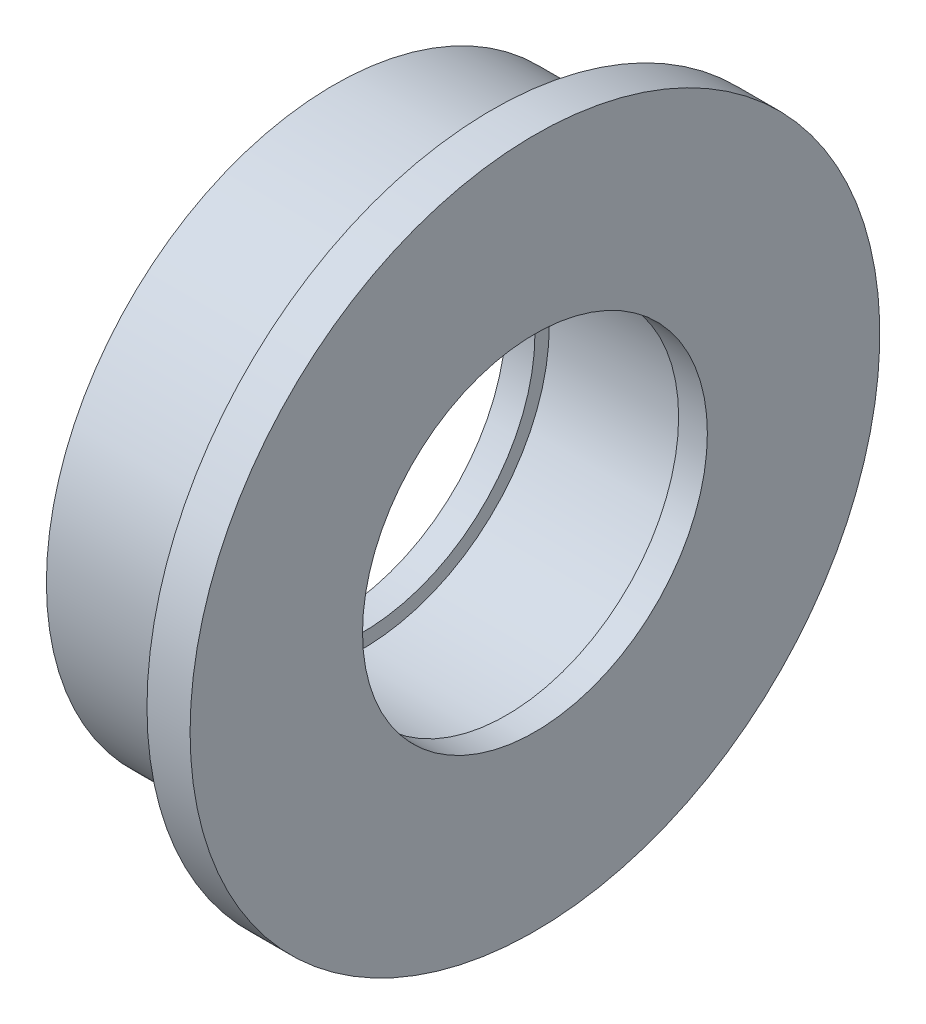
ISO-10303-21;
HEADER;
FILE_DESCRIPTION(('STEP AP214'),'2;1');
FILE_NAME('part.step','',(''),(''),'','','');
FILE_SCHEMA(('AUTOMOTIVE_DESIGN { 1 0 10303 214 1 1 1 1 }'));
ENDSEC;
DATA;
#1=APPLICATION_CONTEXT('core data for automotive mechanical design processes');
#2=APPLICATION_PROTOCOL_DEFINITION('international standard','automotive_design',2000,#1);
#3=PRODUCT_CONTEXT('',#1,'mechanical');
#4=PRODUCT('Part','Part','',(#3));
#5=PRODUCT_RELATED_PRODUCT_CATEGORY('part','',(#4));
#6=PRODUCT_DEFINITION_FORMATION('','',#4);
#7=PRODUCT_DEFINITION_CONTEXT('part definition',#1,'design');
#8=PRODUCT_DEFINITION('design','',#6,#7);
#9=PRODUCT_DEFINITION_SHAPE('','',#8);
#10=(LENGTH_UNIT() NAMED_UNIT(*) SI_UNIT(.MILLI.,.METRE.));
#11=(NAMED_UNIT(*) PLANE_ANGLE_UNIT() SI_UNIT($,.RADIAN.));
#12=(NAMED_UNIT(*) SI_UNIT($,.STERADIAN.) SOLID_ANGLE_UNIT());
#13=UNCERTAINTY_MEASURE_WITH_UNIT(LENGTH_MEASURE(1.E-05),#10,'distance_accuracy_value','');
#14=(GEOMETRIC_REPRESENTATION_CONTEXT(3) GLOBAL_UNCERTAINTY_ASSIGNED_CONTEXT((#13)) GLOBAL_UNIT_ASSIGNED_CONTEXT((#10,
#11,#12)) REPRESENTATION_CONTEXT('',''));
#15=CARTESIAN_POINT('',(0.,0.,0.));
#16=DIRECTION('',(0.,0.,1.));
#17=DIRECTION('',(1.,0.,0.));
#18=AXIS2_PLACEMENT_3D('',#15,#16,#17);
#19=CARTESIAN_POINT('',(2.5,-6.5,-6.63));
#20=DIRECTION('',(-1.,0.,0.));
#21=DIRECTION('',(0.,0.,1.));
#22=AXIS2_PLACEMENT_3D('',#19,#20,#21);
#23=PLANE('',#22);
#24=CARTESIAN_POINT('',(2.5,0.,0.));
#25=DIRECTION('',(1.,0.,0.));
#26=DIRECTION('',(0.,0.,-1.));
#27=AXIS2_PLACEMENT_3D('',#24,#25,#26);
#28=CIRCLE('',#27,6.);
#29=CARTESIAN_POINT('',(2.5,0.,-6.));
#30=VERTEX_POINT('',#29);
#31=EDGE_CURVE('E19',#30,#30,#28,.F.);
#32=ORIENTED_EDGE('',*,*,#31,.F.);
#33=EDGE_LOOP('',(#32));
#34=FACE_BOUND('',#33,.T.);
#35=CARTESIAN_POINT('',(2.5,0.,0.));
#36=DIRECTION('',(1.,0.,0.));
#37=DIRECTION('',(0.,0.,-1.));
#38=AXIS2_PLACEMENT_3D('',#35,#36,#37);
#39=CIRCLE('',#38,6.5);
#40=CARTESIAN_POINT('',(2.5,0.,-6.5));
#41=VERTEX_POINT('',#40);
#42=EDGE_CURVE('E47',#41,#41,#39,.T.);
#43=ORIENTED_EDGE('',*,*,#42,.F.);
#44=EDGE_LOOP('',(#43));
#45=FACE_BOUND('',#44,.T.);
#46=ADVANCED_FACE('F15',(#34,#45),#23,.T.);
#47=CARTESIAN_POINT('',(2.5,0.,0.));
#48=DIRECTION('',(1.,0.,0.));
#49=DIRECTION('',(0.,0.,-1.));
#50=AXIS2_PLACEMENT_3D('',#47,#48,#49);
#51=CYLINDRICAL_SURFACE('',#50,6.);
#52=ORIENTED_EDGE('',*,*,#31,.T.);
#53=EDGE_LOOP('',(#52));
#54=FACE_BOUND('',#53,.T.);
#55=CARTESIAN_POINT('',(3.5,0.,0.));
#56=DIRECTION('',(1.,0.,0.));
#57=DIRECTION('',(0.,0.,-1.));
#58=AXIS2_PLACEMENT_3D('',#55,#56,#57);
#59=CIRCLE('',#58,6.);
#60=CARTESIAN_POINT('',(3.5,0.,-6.));
#61=VERTEX_POINT('',#60);
#62=EDGE_CURVE('E45',#61,#61,#59,.F.);
#63=ORIENTED_EDGE('',*,*,#62,.F.);
#64=EDGE_LOOP('',(#63));
#65=FACE_BOUND('',#64,.T.);
#66=ADVANCED_FACE('F54',(#54,#65),#51,.F.);
#67=CARTESIAN_POINT('',(-2.5,0.,0.));
#68=DIRECTION('',(1.,0.,0.));
#69=DIRECTION('',(0.,0.,-1.));
#70=AXIS2_PLACEMENT_3D('',#67,#68,#69);
#71=CYLINDRICAL_SURFACE('',#70,6.5);
#72=CARTESIAN_POINT('',(-2.5,0.,0.));
#73=DIRECTION('',(1.,0.,0.));
#74=DIRECTION('',(0.,0.,-1.));
#75=AXIS2_PLACEMENT_3D('',#72,#73,#74);
#76=CIRCLE('',#75,6.5);
#77=CARTESIAN_POINT('',(-2.5,0.,-6.5));
#78=VERTEX_POINT('',#77);
#79=EDGE_CURVE('E42',#78,#78,#76,.T.);
#80=ORIENTED_EDGE('',*,*,#79,.F.);
#81=EDGE_LOOP('',(#80));
#82=FACE_BOUND('',#81,.T.);
#83=ORIENTED_EDGE('',*,*,#42,.T.);
#84=EDGE_LOOP('',(#83));
#85=FACE_BOUND('',#84,.T.);
#86=ADVANCED_FACE('F64',(#82,#85),#71,.F.);
#87=CARTESIAN_POINT('',(3.5,-12.,12.24));
#88=DIRECTION('',(1.,0.,0.));
#89=DIRECTION('',(0.,0.,-1.));
#90=AXIS2_PLACEMENT_3D('',#87,#88,#89);
#91=PLANE('',#90);
#92=ORIENTED_EDGE('',*,*,#62,.T.);
#93=EDGE_LOOP('',(#92));
#94=FACE_BOUND('',#93,.T.);
#95=CARTESIAN_POINT('',(3.5,0.,0.));
#96=DIRECTION('',(-1.,0.,0.));
#97=DIRECTION('',(0.,0.,1.));
#98=AXIS2_PLACEMENT_3D('',#95,#96,#97);
#99=CIRCLE('',#98,12.);
#100=CARTESIAN_POINT('',(3.5,0.,12.));
#101=VERTEX_POINT('',#100);
#102=EDGE_CURVE('E39',#101,#101,#99,.T.);
#103=ORIENTED_EDGE('',*,*,#102,.F.);
#104=EDGE_LOOP('',(#103));
#105=FACE_BOUND('',#104,.T.);
#106=ADVANCED_FACE('F89',(#94,#105),#91,.T.);
#107=CARTESIAN_POINT('',(-2.5,-6.5,6.63));
#108=DIRECTION('',(1.,0.,0.));
#109=DIRECTION('',(0.,0.,-1.));
#110=AXIS2_PLACEMENT_3D('',#107,#108,#109);
#111=PLANE('',#110);
#112=CARTESIAN_POINT('',(-2.5,0.,0.));
#113=DIRECTION('',(1.,0.,0.));
#114=DIRECTION('',(0.,0.,-1.));
#115=AXIS2_PLACEMENT_3D('',#112,#113,#114);
#116=CIRCLE('',#115,6.);
#117=CARTESIAN_POINT('',(-2.5,0.,-6.));
#118=VERTEX_POINT('',#117);
#119=EDGE_CURVE('E36',#118,#118,#116,.T.);
#120=ORIENTED_EDGE('',*,*,#119,.F.);
#121=EDGE_LOOP('',(#120));
#122=FACE_BOUND('',#121,.T.);
#123=ORIENTED_EDGE('',*,*,#79,.T.);
#124=EDGE_LOOP('',(#123));
#125=FACE_BOUND('',#124,.T.);
#126=ADVANCED_FACE('F85',(#122,#125),#111,.T.);
#127=CARTESIAN_POINT('',(3.5,0.,0.));
#128=DIRECTION('',(-1.,0.,0.));
#129=DIRECTION('',(0.,0.,1.));
#130=AXIS2_PLACEMENT_3D('',#127,#128,#129);
#131=CYLINDRICAL_SURFACE('',#130,12.);
#132=CARTESIAN_POINT('',(2.,0.,0.));
#133=DIRECTION('',(-1.,0.,0.));
#134=DIRECTION('',(0.,0.,1.));
#135=AXIS2_PLACEMENT_3D('',#132,#133,#134);
#136=CIRCLE('',#135,12.);
#137=CARTESIAN_POINT('',(2.,0.,12.));
#138=VERTEX_POINT('',#137);
#139=EDGE_CURVE('E33',#138,#138,#136,.T.);
#140=ORIENTED_EDGE('',*,*,#139,.F.);
#141=EDGE_LOOP('',(#140));
#142=FACE_BOUND('',#141,.T.);
#143=ORIENTED_EDGE('',*,*,#102,.T.);
#144=EDGE_LOOP('',(#143));
#145=FACE_BOUND('',#144,.T.);
#146=ADVANCED_FACE('F82',(#142,#145),#131,.T.);
#147=CARTESIAN_POINT('',(-3.5,0.,0.));
#148=DIRECTION('',(1.,0.,0.));
#149=DIRECTION('',(0.,0.,-1.));
#150=AXIS2_PLACEMENT_3D('',#147,#148,#149);
#151=CYLINDRICAL_SURFACE('',#150,6.);
#152=CARTESIAN_POINT('',(-3.5,0.,0.));
#153=DIRECTION('',(1.,0.,0.));
#154=DIRECTION('',(0.,0.,-1.));
#155=AXIS2_PLACEMENT_3D('',#152,#153,#154);
#156=CIRCLE('',#155,6.);
#157=CARTESIAN_POINT('',(-3.5,0.,-6.));
#158=VERTEX_POINT('',#157);
#159=EDGE_CURVE('E28',#158,#158,#156,.T.);
#160=ORIENTED_EDGE('',*,*,#159,.F.);
#161=EDGE_LOOP('',(#160));
#162=FACE_BOUND('',#161,.T.);
#163=ORIENTED_EDGE('',*,*,#119,.T.);
#164=EDGE_LOOP('',(#163));
#165=FACE_BOUND('',#164,.T.);
#166=ADVANCED_FACE('F78',(#162,#165),#151,.F.);
#167=CARTESIAN_POINT('',(2.,-12.,-12.24));
#168=DIRECTION('',(-1.,0.,0.));
#169=DIRECTION('',(0.,0.,1.));
#170=AXIS2_PLACEMENT_3D('',#167,#168,#169);
#171=PLANE('',#170);
#172=CARTESIAN_POINT('',(2.,0.,0.));
#173=DIRECTION('',(-1.,0.,0.));
#174=DIRECTION('',(0.,0.,1.));
#175=AXIS2_PLACEMENT_3D('',#172,#173,#174);
#176=CIRCLE('',#175,10.);
#177=CARTESIAN_POINT('',(2.,0.,10.));
#178=VERTEX_POINT('',#177);
#179=EDGE_CURVE('E23',#178,#178,#176,.T.);
#180=ORIENTED_EDGE('',*,*,#179,.F.);
#181=EDGE_LOOP('',(#180));
#182=FACE_BOUND('',#181,.T.);
#183=ORIENTED_EDGE('',*,*,#139,.T.);
#184=EDGE_LOOP('',(#183));
#185=FACE_BOUND('',#184,.T.);
#186=ADVANCED_FACE('F71',(#182,#185),#171,.T.);
#187=CARTESIAN_POINT('',(-3.5,-10.,-10.2));
#188=DIRECTION('',(-1.,0.,0.));
#189=DIRECTION('',(0.,0.,1.));
#190=AXIS2_PLACEMENT_3D('',#187,#188,#189);
#191=PLANE('',#190);
#192=ORIENTED_EDGE('',*,*,#159,.T.);
#193=EDGE_LOOP('',(#192));
#194=FACE_BOUND('',#193,.T.);
#195=CARTESIAN_POINT('',(-3.5,0.,0.));
#196=DIRECTION('',(-1.,0.,0.));
#197=DIRECTION('',(0.,0.,1.));
#198=AXIS2_PLACEMENT_3D('',#195,#196,#197);
#199=CIRCLE('',#198,10.);
#200=CARTESIAN_POINT('',(-3.5,0.,10.));
#201=VERTEX_POINT('',#200);
#202=EDGE_CURVE('E10',#201,#201,#199,.F.);
#203=ORIENTED_EDGE('',*,*,#202,.F.);
#204=EDGE_LOOP('',(#203));
#205=FACE_BOUND('',#204,.T.);
#206=ADVANCED_FACE('F67',(#194,#205),#191,.T.);
#207=CARTESIAN_POINT('',(2.,0.,0.));
#208=DIRECTION('',(-1.,0.,0.));
#209=DIRECTION('',(0.,0.,1.));
#210=AXIS2_PLACEMENT_3D('',#207,#208,#209);
#211=CYLINDRICAL_SURFACE('',#210,10.);
#212=ORIENTED_EDGE('',*,*,#202,.T.);
#213=EDGE_LOOP('',(#212));
#214=FACE_BOUND('',#213,.T.);
#215=ORIENTED_EDGE('',*,*,#179,.T.);
#216=EDGE_LOOP('',(#215));
#217=FACE_BOUND('',#216,.T.);
#218=ADVANCED_FACE('F17',(#214,#217),#211,.T.);
#219=CLOSED_SHELL('',(#46,#66,#86,#106,#126,#146,#166,#186,#206,#218));
#220=MANIFOLD_SOLID_BREP('B1',#219);
#221=ADVANCED_BREP_SHAPE_REPRESENTATION('',(#18,#220),#14);
#222=SHAPE_DEFINITION_REPRESENTATION(#9,#221);
ENDSEC;
END-ISO-10303-21;
